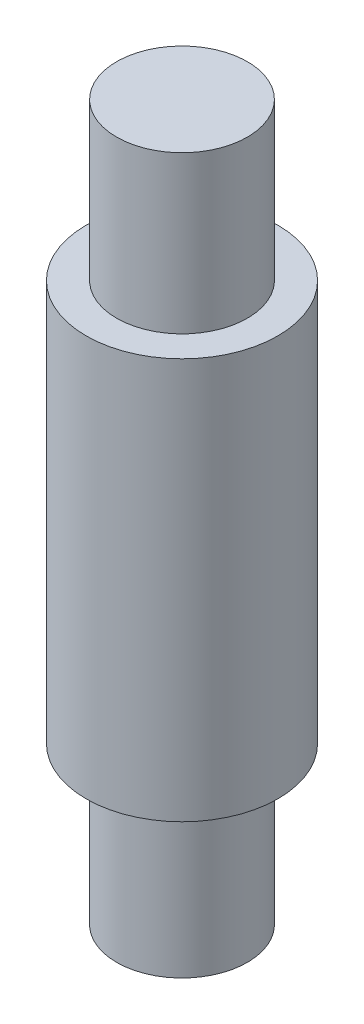
ISO-10303-21;
HEADER;
FILE_DESCRIPTION(('STEP AP214'),'2;1');
FILE_NAME('part.step','',(''),(''),'','','');
FILE_SCHEMA(('AUTOMOTIVE_DESIGN { 1 0 10303 214 1 1 1 1 }'));
ENDSEC;
DATA;
#1=APPLICATION_CONTEXT('core data for automotive mechanical design processes');
#2=APPLICATION_PROTOCOL_DEFINITION('international standard','automotive_design',2000,#1);
#3=PRODUCT_CONTEXT('',#1,'mechanical');
#4=PRODUCT('Part','Part','',(#3));
#5=PRODUCT_RELATED_PRODUCT_CATEGORY('part','',(#4));
#6=PRODUCT_DEFINITION_FORMATION('','',#4);
#7=PRODUCT_DEFINITION_CONTEXT('part definition',#1,'design');
#8=PRODUCT_DEFINITION('design','',#6,#7);
#9=PRODUCT_DEFINITION_SHAPE('','',#8);
#10=(LENGTH_UNIT() NAMED_UNIT(*) SI_UNIT(.MILLI.,.METRE.));
#11=(NAMED_UNIT(*) PLANE_ANGLE_UNIT() SI_UNIT($,.RADIAN.));
#12=(NAMED_UNIT(*) SI_UNIT($,.STERADIAN.) SOLID_ANGLE_UNIT());
#13=UNCERTAINTY_MEASURE_WITH_UNIT(LENGTH_MEASURE(1.E-05),#10,'distance_accuracy_value','');
#14=(GEOMETRIC_REPRESENTATION_CONTEXT(3) GLOBAL_UNCERTAINTY_ASSIGNED_CONTEXT((#13)) GLOBAL_UNIT_ASSIGNED_CONTEXT((#10,
#11,#12)) REPRESENTATION_CONTEXT('',''));
#15=CARTESIAN_POINT('',(0.,0.,0.));
#16=DIRECTION('',(0.,0.,1.));
#17=DIRECTION('',(1.,0.,0.));
#18=AXIS2_PLACEMENT_3D('',#15,#16,#17);
#19=CARTESIAN_POINT('',(0.,23.,0.));
#20=DIRECTION('',(0.,-1.,0.));
#21=DIRECTION('',(0.,0.,-1.));
#22=AXIS2_PLACEMENT_3D('',#19,#20,#21);
#23=CYLINDRICAL_SURFACE('',#22,11.);
#24=CARTESIAN_POINT('',(0.,23.,0.));
#25=DIRECTION('',(0.,1.,0.));
#26=DIRECTION('',(0.,0.,1.));
#27=AXIS2_PLACEMENT_3D('',#24,#25,#26);
#28=CIRCLE('',#27,11.);
#29=CARTESIAN_POINT('',(0.,23.,11.));
#30=VERTEX_POINT('',#29);
#31=EDGE_CURVE('E46',#30,#30,#28,.T.);
#32=ORIENTED_EDGE('',*,*,#31,.F.);
#33=EDGE_LOOP('',(#32));
#34=FACE_BOUND('',#33,.T.);
#35=CARTESIAN_POINT('',(0.,-23.,0.));
#36=DIRECTION('',(0.,1.,0.));
#37=DIRECTION('',(0.,0.,1.));
#38=AXIS2_PLACEMENT_3D('',#35,#36,#37);
#39=CIRCLE('',#38,11.);
#40=CARTESIAN_POINT('',(0.,-23.,11.));
#41=VERTEX_POINT('',#40);
#42=EDGE_CURVE('E50',#41,#41,#39,.T.);
#43=ORIENTED_EDGE('',*,*,#42,.T.);
#44=EDGE_LOOP('',(#43));
#45=FACE_BOUND('',#44,.T.);
#46=ADVANCED_FACE('F40',(#34,#45),#23,.T.);
#47=CARTESIAN_POINT('',(0.,23.,0.));
#48=DIRECTION('',(0.,1.,0.));
#49=DIRECTION('',(0.,0.,1.));
#50=AXIS2_PLACEMENT_3D('',#47,#48,#49);
#51=PLANE('',#50);
#52=CARTESIAN_POINT('',(0.,23.,0.));
#53=DIRECTION('',(0.,1.,0.));
#54=DIRECTION('',(0.,0.,1.));
#55=AXIS2_PLACEMENT_3D('',#52,#53,#54);
#56=CIRCLE('',#55,7.5);
#57=CARTESIAN_POINT('',(0.,23.,7.5));
#58=VERTEX_POINT('',#57);
#59=EDGE_CURVE('E55',#58,#58,#56,.F.);
#60=ORIENTED_EDGE('',*,*,#59,.T.);
#61=EDGE_LOOP('',(#60));
#62=FACE_BOUND('',#61,.T.);
#63=ORIENTED_EDGE('',*,*,#31,.T.);
#64=EDGE_LOOP('',(#63));
#65=FACE_BOUND('',#64,.T.);
#66=ADVANCED_FACE('F84',(#62,#65),#51,.T.);
#67=CARTESIAN_POINT('',(0.,-23.,0.));
#68=DIRECTION('',(0.,1.,0.));
#69=DIRECTION('',(0.,0.,1.));
#70=AXIS2_PLACEMENT_3D('',#67,#68,#69);
#71=PLANE('',#70);
#72=CARTESIAN_POINT('',(0.,-23.,0.));
#73=DIRECTION('',(0.,1.,0.));
#74=DIRECTION('',(0.,0.,1.));
#75=AXIS2_PLACEMENT_3D('',#72,#73,#74);
#76=CIRCLE('',#75,7.5);
#77=CARTESIAN_POINT('',(0.,-23.,7.5));
#78=VERTEX_POINT('',#77);
#79=EDGE_CURVE('E10',#78,#78,#76,.F.);
#80=ORIENTED_EDGE('',*,*,#79,.F.);
#81=EDGE_LOOP('',(#80));
#82=FACE_BOUND('',#81,.T.);
#83=ORIENTED_EDGE('',*,*,#42,.F.);
#84=EDGE_LOOP('',(#83));
#85=FACE_BOUND('',#84,.T.);
#86=ADVANCED_FACE('F89',(#82,#85),#71,.F.);
#87=CARTESIAN_POINT('',(0.,-41.,0.));
#88=DIRECTION('',(0.,1.,0.));
#89=DIRECTION('',(0.,0.,1.));
#90=AXIS2_PLACEMENT_3D('',#87,#88,#89);
#91=PLANE('',#90);
#92=CARTESIAN_POINT('',(0.,-41.,0.));
#93=DIRECTION('',(0.,1.,0.));
#94=DIRECTION('',(0.,0.,1.));
#95=AXIS2_PLACEMENT_3D('',#92,#93,#94);
#96=CIRCLE('',#95,7.5);
#97=CARTESIAN_POINT('',(0.,-41.,7.5));
#98=VERTEX_POINT('',#97);
#99=EDGE_CURVE('E60',#98,#98,#96,.T.);
#100=ORIENTED_EDGE('',*,*,#99,.F.);
#101=EDGE_LOOP('',(#100));
#102=FACE_BOUND('',#101,.T.);
#103=ADVANCED_FACE('F78',(#102),#91,.F.);
#104=CARTESIAN_POINT('',(0.,41.,0.));
#105=DIRECTION('',(0.,-1.,0.));
#106=DIRECTION('',(0.,0.,-1.));
#107=AXIS2_PLACEMENT_3D('',#104,#105,#106);
#108=CYLINDRICAL_SURFACE('',#107,7.5);
#109=ORIENTED_EDGE('',*,*,#99,.T.);
#110=EDGE_LOOP('',(#109));
#111=FACE_BOUND('',#110,.T.);
#112=ORIENTED_EDGE('',*,*,#79,.T.);
#113=EDGE_LOOP('',(#112));
#114=FACE_BOUND('',#113,.T.);
#115=ADVANCED_FACE('F70',(#111,#114),#108,.T.);
#116=ORIENTED_EDGE('',*,*,#59,.F.);
#117=EDGE_LOOP('',(#116));
#118=FACE_BOUND('',#117,.T.);
#119=CARTESIAN_POINT('',(0.,41.,0.));
#120=DIRECTION('',(0.,1.,0.));
#121=DIRECTION('',(0.,0.,1.));
#122=AXIS2_PLACEMENT_3D('',#119,#120,#121);
#123=CIRCLE('',#122,7.5);
#124=CARTESIAN_POINT('',(0.,41.,7.5));
#125=VERTEX_POINT('',#124);
#126=EDGE_CURVE('E59',#125,#125,#123,.T.);
#127=ORIENTED_EDGE('',*,*,#126,.F.);
#128=EDGE_LOOP('',(#127));
#129=FACE_BOUND('',#128,.T.);
#130=ADVANCED_FACE('F68',(#118,#129),#108,.T.);
#131=CARTESIAN_POINT('',(0.,41.,0.));
#132=DIRECTION('',(0.,1.,0.));
#133=DIRECTION('',(0.,0.,1.));
#134=AXIS2_PLACEMENT_3D('',#131,#132,#133);
#135=PLANE('',#134);
#136=ORIENTED_EDGE('',*,*,#126,.T.);
#137=EDGE_LOOP('',(#136));
#138=FACE_BOUND('',#137,.T.);
#139=ADVANCED_FACE('F66',(#138),#135,.T.);
#140=CLOSED_SHELL('',(#46,#66,#86,#103,#115,#130,#139));
#141=MANIFOLD_SOLID_BREP('B2',#140);
#142=ADVANCED_BREP_SHAPE_REPRESENTATION('',(#18,#141),#14);
#143=SHAPE_DEFINITION_REPRESENTATION(#9,#142);
ENDSEC;
END-ISO-10303-21;
